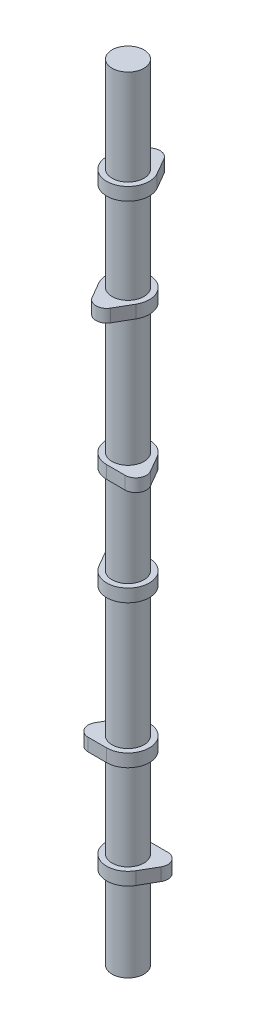
ISO-10303-21;
HEADER;
FILE_DESCRIPTION(('STEP AP214'),'2;1');
FILE_NAME('part.step','',(''),(''),'','','');
FILE_SCHEMA(('AUTOMOTIVE_DESIGN { 1 0 10303 214 1 1 1 1 }'));
ENDSEC;
DATA;
#1=APPLICATION_CONTEXT('core data for automotive mechanical design processes');
#2=APPLICATION_PROTOCOL_DEFINITION('international standard','automotive_design',2000,#1);
#3=PRODUCT_CONTEXT('',#1,'mechanical');
#4=PRODUCT('Part','Part','',(#3));
#5=PRODUCT_RELATED_PRODUCT_CATEGORY('part','',(#4));
#6=PRODUCT_DEFINITION_FORMATION('','',#4);
#7=PRODUCT_DEFINITION_CONTEXT('part definition',#1,'design');
#8=PRODUCT_DEFINITION('design','',#6,#7);
#9=PRODUCT_DEFINITION_SHAPE('','',#8);
#10=(LENGTH_UNIT() NAMED_UNIT(*) SI_UNIT(.MILLI.,.METRE.));
#11=(NAMED_UNIT(*) PLANE_ANGLE_UNIT() SI_UNIT($,.RADIAN.));
#12=(NAMED_UNIT(*) SI_UNIT($,.STERADIAN.) SOLID_ANGLE_UNIT());
#13=UNCERTAINTY_MEASURE_WITH_UNIT(LENGTH_MEASURE(1.E-05),#10,'distance_accuracy_value','');
#14=(GEOMETRIC_REPRESENTATION_CONTEXT(3) GLOBAL_UNCERTAINTY_ASSIGNED_CONTEXT((#13)) GLOBAL_UNIT_ASSIGNED_CONTEXT((#10,
#11,#12)) REPRESENTATION_CONTEXT('',''));
#15=CARTESIAN_POINT('',(0.,0.,0.));
#16=DIRECTION('',(0.,0.,1.));
#17=DIRECTION('',(1.,0.,0.));
#18=AXIS2_PLACEMENT_3D('',#15,#16,#17);
#19=CARTESIAN_POINT('',(0.,3.81,-12.7));
#20=DIRECTION('',(0.,-1.,0.));
#21=DIRECTION('',(0.,0.,-1.));
#22=AXIS2_PLACEMENT_3D('',#19,#20,#21);
#23=CYLINDRICAL_SURFACE('',#22,6.35);
#24=CARTESIAN_POINT('',(0.,-3.81,-12.7));
#25=DIRECTION('',(0.,1.,0.));
#26=DIRECTION('',(0.,0.,1.));
#27=AXIS2_PLACEMENT_3D('',#24,#25,#26);
#28=CIRCLE('',#27,6.35);
#29=CARTESIAN_POINT('',(5.49926131403119,-3.81,-15.875));
#30=VERTEX_POINT('',#29);
#31=CARTESIAN_POINT('',(-5.49926131403119,-3.81,-15.875));
#32=VERTEX_POINT('',#31);
#33=EDGE_CURVE('E438',#30,#32,#28,.T.);
#34=ORIENTED_EDGE('',*,*,#33,.T.);
#35=DIRECTION('',(0.,-1.,0.));
#36=VECTOR('',#35,1.);
#37=CARTESIAN_POINT('',(-5.49926131403119,3.81,-15.875));
#38=LINE('',#37,#36);
#39=CARTESIAN_POINT('',(-5.49926131403119,3.81,-15.875));
#40=VERTEX_POINT('',#39);
#41=EDGE_CURVE('E468',#40,#32,#38,.T.);
#42=ORIENTED_EDGE('',*,*,#41,.F.);
#43=CARTESIAN_POINT('',(0.,3.81,-12.7));
#44=DIRECTION('',(0.,1.,0.));
#45=DIRECTION('',(0.,0.,1.));
#46=AXIS2_PLACEMENT_3D('',#43,#44,#45);
#47=CIRCLE('',#46,6.35);
#48=CARTESIAN_POINT('',(5.49926131403119,3.81,-15.875));
#49=VERTEX_POINT('',#48);
#50=EDGE_CURVE('E439',#49,#40,#47,.T.);
#51=ORIENTED_EDGE('',*,*,#50,.F.);
#52=DIRECTION('',(0.,-1.,0.));
#53=VECTOR('',#52,1.);
#54=CARTESIAN_POINT('',(5.49926131403119,3.81,-15.875));
#55=LINE('',#54,#53);
#56=EDGE_CURVE('E449',#49,#30,#55,.T.);
#57=ORIENTED_EDGE('',*,*,#56,.T.);
#58=EDGE_LOOP('',(#34,#42,#51,#57));
#59=FACE_BOUND('',#58,.T.);
#60=ADVANCED_FACE('F45',(#59),#23,.T.);
#61=CARTESIAN_POINT('',(-5.49926131403119,3.81,-15.875));
#62=DIRECTION('',(0.866025403784439,0.,0.5));
#63=DIRECTION('',(0.5,0.,-0.866025403784439));
#64=AXIS2_PLACEMENT_3D('',#61,#62,#63);
#65=PLANE('',#64);
#66=DIRECTION('',(-0.5,0.,0.866025403784439));
#67=VECTOR('',#66,1.);
#68=CARTESIAN_POINT('',(-5.49926131403119,-3.81,-15.875));
#69=LINE('',#68,#67);
#70=CARTESIAN_POINT('',(-10.9985226280624,-3.81,-6.34999999999999));
#71=VERTEX_POINT('',#70);
#72=EDGE_CURVE('E453',#32,#71,#69,.T.);
#73=ORIENTED_EDGE('',*,*,#72,.T.);
#74=DIRECTION('',(0.,-1.,0.));
#75=VECTOR('',#74,1.);
#76=CARTESIAN_POINT('',(-10.9985226280624,3.81,-6.34999999999999));
#77=LINE('',#76,#75);
#78=CARTESIAN_POINT('',(-10.9985226280624,3.81,-6.34999999999999));
#79=VERTEX_POINT('',#78);
#80=EDGE_CURVE('E465',#79,#71,#77,.T.);
#81=ORIENTED_EDGE('',*,*,#80,.F.);
#82=DIRECTION('',(-0.5,0.,0.866025403784439));
#83=VECTOR('',#82,1.);
#84=CARTESIAN_POINT('',(-5.49926131403119,3.81,-15.875));
#85=LINE('',#84,#83);
#86=EDGE_CURVE('E95',#40,#79,#85,.T.);
#87=ORIENTED_EDGE('',*,*,#86,.F.);
#88=ORIENTED_EDGE('',*,*,#41,.T.);
#89=EDGE_LOOP('',(#73,#81,#87,#88));
#90=FACE_BOUND('',#89,.T.);
#91=ADVANCED_FACE('F542',(#90),#65,.F.);
#92=CARTESIAN_POINT('',(0.,3.81,0.));
#93=DIRECTION('',(0.,-1.,0.));
#94=DIRECTION('',(0.,0.,-1.));
#95=AXIS2_PLACEMENT_3D('',#92,#93,#94);
#96=CYLINDRICAL_SURFACE('',#95,12.7);
#97=CARTESIAN_POINT('',(0.,-3.81,0.));
#98=DIRECTION('',(0.,1.,0.));
#99=DIRECTION('',(0.,0.,1.));
#100=AXIS2_PLACEMENT_3D('',#97,#98,#99);
#101=CIRCLE('',#100,12.7);
#102=CARTESIAN_POINT('',(10.9985226280624,-3.81,-6.35));
#103=VERTEX_POINT('',#102);
#104=EDGE_CURVE('E81',#71,#103,#101,.T.);
#105=ORIENTED_EDGE('',*,*,#104,.T.);
#106=DIRECTION('',(0.,-1.,0.));
#107=VECTOR('',#106,1.);
#108=CARTESIAN_POINT('',(10.9985226280624,3.81,-6.35));
#109=LINE('',#108,#107);
#110=CARTESIAN_POINT('',(10.9985226280624,3.81,-6.35));
#111=VERTEX_POINT('',#110);
#112=EDGE_CURVE('E462',#111,#103,#109,.T.);
#113=ORIENTED_EDGE('',*,*,#112,.F.);
#114=CARTESIAN_POINT('',(0.,3.81,0.));
#115=DIRECTION('',(0.,1.,0.));
#116=DIRECTION('',(0.,0.,1.));
#117=AXIS2_PLACEMENT_3D('',#114,#115,#116);
#118=CIRCLE('',#117,12.7);
#119=EDGE_CURVE('E444',#79,#111,#118,.T.);
#120=ORIENTED_EDGE('',*,*,#119,.F.);
#121=ORIENTED_EDGE('',*,*,#80,.T.);
#122=EDGE_LOOP('',(#105,#113,#120,#121));
#123=FACE_BOUND('',#122,.T.);
#124=ADVANCED_FACE('F547',(#123),#96,.T.);
#125=CARTESIAN_POINT('',(5.49926131403119,3.81,-15.875));
#126=DIRECTION('',(-0.866025403784439,0.,0.5));
#127=DIRECTION('',(0.5,0.,0.866025403784439));
#128=AXIS2_PLACEMENT_3D('',#125,#126,#127);
#129=PLANE('',#128);
#130=DIRECTION('',(-0.5,0.,-0.866025403784439));
#131=VECTOR('',#130,1.);
#132=CARTESIAN_POINT('',(5.49926131403119,-3.81,-15.875));
#133=LINE('',#132,#131);
#134=EDGE_CURVE('E87',#103,#30,#133,.T.);
#135=ORIENTED_EDGE('',*,*,#134,.T.);
#136=ORIENTED_EDGE('',*,*,#56,.F.);
#137=DIRECTION('',(-0.5,0.,-0.866025403784439));
#138=VECTOR('',#137,1.);
#139=CARTESIAN_POINT('',(5.49926131403119,3.81,-15.875));
#140=LINE('',#139,#138);
#141=EDGE_CURVE('E63',#111,#49,#140,.T.);
#142=ORIENTED_EDGE('',*,*,#141,.F.);
#143=ORIENTED_EDGE('',*,*,#112,.T.);
#144=EDGE_LOOP('',(#135,#136,#142,#143));
#145=FACE_BOUND('',#144,.T.);
#146=ADVANCED_FACE('F556',(#145),#129,.F.);
#147=CARTESIAN_POINT('',(0.,3.81,-12.7));
#148=DIRECTION('',(0.,1.,0.));
#149=DIRECTION('',(0.,0.,1.));
#150=AXIS2_PLACEMENT_3D('',#147,#148,#149);
#151=PLANE('',#150);
#152=CARTESIAN_POINT('',(0.,3.81,0.));
#153=DIRECTION('',(0.,1.,0.));
#154=DIRECTION('',(0.,0.,1.));
#155=AXIS2_PLACEMENT_3D('',#152,#153,#154);
#156=CIRCLE('',#155,9.5);
#157=CARTESIAN_POINT('',(0.,3.81,9.5));
#158=VERTEX_POINT('',#157);
#159=EDGE_CURVE('E434',#158,#158,#156,.F.);
#160=ORIENTED_EDGE('',*,*,#159,.T.);
#161=EDGE_LOOP('',(#160));
#162=FACE_BOUND('',#161,.T.);
#163=ORIENTED_EDGE('',*,*,#50,.T.);
#164=ORIENTED_EDGE('',*,*,#86,.T.);
#165=ORIENTED_EDGE('',*,*,#119,.T.);
#166=ORIENTED_EDGE('',*,*,#141,.T.);
#167=EDGE_LOOP('',(#163,#164,#165,#166));
#168=FACE_BOUND('',#167,.T.);
#169=ADVANCED_FACE('F554',(#162,#168),#151,.T.);
#170=CARTESIAN_POINT('',(0.,-3.81,-12.7));
#171=DIRECTION('',(0.,1.,0.));
#172=DIRECTION('',(0.,0.,1.));
#173=AXIS2_PLACEMENT_3D('',#170,#171,#172);
#174=PLANE('',#173);
#175=CARTESIAN_POINT('',(0.,-3.81,0.));
#176=DIRECTION('',(0.,1.,0.));
#177=DIRECTION('',(0.,0.,1.));
#178=AXIS2_PLACEMENT_3D('',#175,#176,#177);
#179=CIRCLE('',#178,9.5);
#180=CARTESIAN_POINT('',(0.,-3.81,9.5));
#181=VERTEX_POINT('',#180);
#182=EDGE_CURVE('E471',#181,#181,#179,.F.);
#183=ORIENTED_EDGE('',*,*,#182,.F.);
#184=EDGE_LOOP('',(#183));
#185=FACE_BOUND('',#184,.T.);
#186=ORIENTED_EDGE('',*,*,#33,.F.);
#187=ORIENTED_EDGE('',*,*,#134,.F.);
#188=ORIENTED_EDGE('',*,*,#104,.F.);
#189=ORIENTED_EDGE('',*,*,#72,.F.);
#190=EDGE_LOOP('',(#186,#187,#188,#189));
#191=FACE_BOUND('',#190,.T.);
#192=ADVANCED_FACE('F552',(#185,#191),#174,.F.);
#193=CARTESIAN_POINT('',(0.,60.53,0.));
#194=DIRECTION('',(0.,-1.,0.));
#195=DIRECTION('',(0.,0.,-1.));
#196=AXIS2_PLACEMENT_3D('',#193,#194,#195);
#197=CYLINDRICAL_SURFACE('',#196,9.5);
#198=CARTESIAN_POINT('',(0.,-57.19,0.));
#199=DIRECTION('',(0.,1.,0.));
#200=DIRECTION('',(0.,0.,1.));
#201=AXIS2_PLACEMENT_3D('',#198,#199,#200);
#202=CIRCLE('',#201,9.5);
#203=CARTESIAN_POINT('',(0.,-57.19,9.5));
#204=VERTEX_POINT('',#203);
#205=EDGE_CURVE('E425',#204,#204,#202,.T.);
#206=ORIENTED_EDGE('',*,*,#205,.T.);
#207=EDGE_LOOP('',(#206));
#208=FACE_BOUND('',#207,.T.);
#209=ORIENTED_EDGE('',*,*,#182,.T.);
#210=EDGE_LOOP('',(#209));
#211=FACE_BOUND('',#210,.T.);
#212=ADVANCED_FACE('F563',(#208,#211),#197,.T.);
#213=ORIENTED_EDGE('',*,*,#159,.F.);
#214=EDGE_LOOP('',(#213));
#215=FACE_BOUND('',#214,.T.);
#216=CARTESIAN_POINT('',(0.,60.53,0.));
#217=DIRECTION('',(0.,1.,0.));
#218=DIRECTION('',(0.,0.,1.));
#219=AXIS2_PLACEMENT_3D('',#216,#217,#218);
#220=CIRCLE('',#219,9.5);
#221=CARTESIAN_POINT('',(0.,60.53,9.5));
#222=VERTEX_POINT('',#221);
#223=EDGE_CURVE('E430',#222,#222,#220,.T.);
#224=ORIENTED_EDGE('',*,*,#223,.F.);
#225=EDGE_LOOP('',(#224));
#226=FACE_BOUND('',#225,.T.);
#227=ADVANCED_FACE('F567',(#215,#226),#197,.T.);
#228=CARTESIAN_POINT('',(0.,60.53,0.));
#229=DIRECTION('',(0.,1.,0.));
#230=DIRECTION('',(0.,0.,1.));
#231=AXIS2_PLACEMENT_3D('',#228,#229,#230);
#232=PLANE('',#231);
#233=ORIENTED_EDGE('',*,*,#223,.T.);
#234=EDGE_LOOP('',(#233));
#235=FACE_BOUND('',#234,.T.);
#236=ADVANCED_FACE('F613',(#235),#232,.T.);
#237=CARTESIAN_POINT('',(0.,-57.19,12.7));
#238=DIRECTION('',(0.,-1.,0.));
#239=DIRECTION('',(0.,0.,1.));
#240=AXIS2_PLACEMENT_3D('',#237,#238,#239);
#241=CYLINDRICAL_SURFACE('',#240,6.35);
#242=CARTESIAN_POINT('',(0.,-64.81,12.7));
#243=DIRECTION('',(0.,1.,0.));
#244=DIRECTION('',(0.,0.,-1.));
#245=AXIS2_PLACEMENT_3D('',#242,#243,#244);
#246=CIRCLE('',#245,6.35);
#247=CARTESIAN_POINT('',(-5.4992613140313,-64.81,15.875));
#248=VERTEX_POINT('',#247);
#249=CARTESIAN_POINT('',(5.49926131403108,-64.81,15.875));
#250=VERTEX_POINT('',#249);
#251=EDGE_CURVE('E398',#248,#250,#246,.T.);
#252=ORIENTED_EDGE('',*,*,#251,.T.);
#253=DIRECTION('',(0.,-1.,0.));
#254=VECTOR('',#253,1.);
#255=CARTESIAN_POINT('',(5.49926131403108,-57.19,15.875));
#256=LINE('',#255,#254);
#257=CARTESIAN_POINT('',(5.49926131403108,-57.19,15.875));
#258=VERTEX_POINT('',#257);
#259=EDGE_CURVE('E421',#258,#250,#256,.T.);
#260=ORIENTED_EDGE('',*,*,#259,.F.);
#261=CARTESIAN_POINT('',(0.,-57.19,12.7));
#262=DIRECTION('',(0.,1.,0.));
#263=DIRECTION('',(0.,0.,-1.));
#264=AXIS2_PLACEMENT_3D('',#261,#262,#263);
#265=CIRCLE('',#264,6.35);
#266=CARTESIAN_POINT('',(-5.4992613140313,-57.19,15.875));
#267=VERTEX_POINT('',#266);
#268=EDGE_CURVE('E383',#267,#258,#265,.T.);
#269=ORIENTED_EDGE('',*,*,#268,.F.);
#270=DIRECTION('',(0.,-1.,0.));
#271=VECTOR('',#270,1.);
#272=CARTESIAN_POINT('',(-5.4992613140313,-57.19,15.875));
#273=LINE('',#272,#271);
#274=EDGE_CURVE('E397',#267,#248,#273,.T.);
#275=ORIENTED_EDGE('',*,*,#274,.T.);
#276=EDGE_LOOP('',(#252,#260,#269,#275));
#277=FACE_BOUND('',#276,.T.);
#278=ADVANCED_FACE('F623',(#277),#241,.T.);
#279=CARTESIAN_POINT('',(5.49926131403108,-57.19,15.875));
#280=DIRECTION('',(-0.866025403784435,0.,-0.500000000000006));
#281=DIRECTION('',(-0.500000000000006,0.,0.866025403784435));
#282=AXIS2_PLACEMENT_3D('',#279,#280,#281);
#283=PLANE('',#282);
#284=DIRECTION('',(0.500000000000006,0.,-0.866025403784435));
#285=VECTOR('',#284,1.);
#286=CARTESIAN_POINT('',(5.49926131403108,-64.81,15.875));
#287=LINE('',#286,#285);
#288=CARTESIAN_POINT('',(10.9985226280623,-64.81,6.35000000000007));
#289=VERTEX_POINT('',#288);
#290=EDGE_CURVE('E402',#250,#289,#287,.T.);
#291=ORIENTED_EDGE('',*,*,#290,.T.);
#292=DIRECTION('',(0.,-1.,0.));
#293=VECTOR('',#292,1.);
#294=CARTESIAN_POINT('',(10.9985226280623,-57.19,6.35000000000007));
#295=LINE('',#294,#293);
#296=CARTESIAN_POINT('',(10.9985226280623,-57.19,6.35000000000007));
#297=VERTEX_POINT('',#296);
#298=EDGE_CURVE('E417',#297,#289,#295,.T.);
#299=ORIENTED_EDGE('',*,*,#298,.F.);
#300=DIRECTION('',(0.500000000000006,0.,-0.866025403784435));
#301=VECTOR('',#300,1.);
#302=CARTESIAN_POINT('',(5.49926131403108,-57.19,15.875));
#303=LINE('',#302,#301);
#304=EDGE_CURVE('E387',#258,#297,#303,.T.);
#305=ORIENTED_EDGE('',*,*,#304,.F.);
#306=ORIENTED_EDGE('',*,*,#259,.T.);
#307=EDGE_LOOP('',(#291,#299,#305,#306));
#308=FACE_BOUND('',#307,.T.);
#309=ADVANCED_FACE('F633',(#308),#283,.F.);
#310=CARTESIAN_POINT('',(0.,-57.19,0.));
#311=DIRECTION('',(0.,-1.,0.));
#312=DIRECTION('',(0.,0.,1.));
#313=AXIS2_PLACEMENT_3D('',#310,#311,#312);
#314=CYLINDRICAL_SURFACE('',#313,12.7);
#315=CARTESIAN_POINT('',(0.,-64.81,0.));
#316=DIRECTION('',(0.,1.,0.));
#317=DIRECTION('',(0.,0.,-1.));
#318=AXIS2_PLACEMENT_3D('',#315,#316,#317);
#319=CIRCLE('',#318,12.7);
#320=CARTESIAN_POINT('',(-10.9985226280624,-64.81,6.34999999999992));
#321=VERTEX_POINT('',#320);
#322=EDGE_CURVE('E405',#289,#321,#319,.T.);
#323=ORIENTED_EDGE('',*,*,#322,.T.);
#324=DIRECTION('',(0.,-1.,0.));
#325=VECTOR('',#324,1.);
#326=CARTESIAN_POINT('',(-10.9985226280624,-57.19,6.34999999999992));
#327=LINE('',#326,#325);
#328=CARTESIAN_POINT('',(-10.9985226280624,-57.19,6.34999999999992));
#329=VERTEX_POINT('',#328);
#330=EDGE_CURVE('E413',#329,#321,#327,.T.);
#331=ORIENTED_EDGE('',*,*,#330,.F.);
#332=CARTESIAN_POINT('',(0.,-57.19,0.));
#333=DIRECTION('',(0.,1.,0.));
#334=DIRECTION('',(0.,0.,-1.));
#335=AXIS2_PLACEMENT_3D('',#332,#333,#334);
#336=CIRCLE('',#335,12.7);
#337=EDGE_CURVE('E391',#297,#329,#336,.T.);
#338=ORIENTED_EDGE('',*,*,#337,.F.);
#339=ORIENTED_EDGE('',*,*,#298,.T.);
#340=EDGE_LOOP('',(#323,#331,#338,#339));
#341=FACE_BOUND('',#340,.T.);
#342=ADVANCED_FACE('F644',(#341),#314,.T.);
#343=CARTESIAN_POINT('',(-5.4992613140313,-57.19,15.875));
#344=DIRECTION('',(0.866025403784442,0.,-0.499999999999994));
#345=DIRECTION('',(-0.499999999999994,0.,-0.866025403784442));
#346=AXIS2_PLACEMENT_3D('',#343,#344,#345);
#347=PLANE('',#346);
#348=DIRECTION('',(0.499999999999994,0.,0.866025403784442));
#349=VECTOR('',#348,1.);
#350=CARTESIAN_POINT('',(-5.4992613140313,-64.81,15.875));
#351=LINE('',#350,#349);
#352=EDGE_CURVE('E388',#321,#248,#351,.T.);
#353=ORIENTED_EDGE('',*,*,#352,.T.);
#354=ORIENTED_EDGE('',*,*,#274,.F.);
#355=DIRECTION('',(0.499999999999994,0.,0.866025403784442));
#356=VECTOR('',#355,1.);
#357=CARTESIAN_POINT('',(-5.4992613140313,-57.19,15.875));
#358=LINE('',#357,#356);
#359=EDGE_CURVE('E394',#329,#267,#358,.T.);
#360=ORIENTED_EDGE('',*,*,#359,.F.);
#361=ORIENTED_EDGE('',*,*,#330,.T.);
#362=EDGE_LOOP('',(#353,#354,#360,#361));
#363=FACE_BOUND('',#362,.T.);
#364=ADVANCED_FACE('F655',(#363),#347,.F.);
#365=CARTESIAN_POINT('',(0.,-57.19,12.7));
#366=DIRECTION('',(0.,1.,0.));
#367=DIRECTION('',(0.,0.,-1.));
#368=AXIS2_PLACEMENT_3D('',#365,#366,#367);
#369=PLANE('',#368);
#370=ORIENTED_EDGE('',*,*,#205,.F.);
#371=EDGE_LOOP('',(#370));
#372=FACE_BOUND('',#371,.T.);
#373=ORIENTED_EDGE('',*,*,#268,.T.);
#374=ORIENTED_EDGE('',*,*,#304,.T.);
#375=ORIENTED_EDGE('',*,*,#337,.T.);
#376=ORIENTED_EDGE('',*,*,#359,.T.);
#377=EDGE_LOOP('',(#373,#374,#375,#376));
#378=FACE_BOUND('',#377,.T.);
#379=ADVANCED_FACE('F666',(#372,#378),#369,.T.);
#380=CARTESIAN_POINT('',(0.,-64.81,12.7));
#381=DIRECTION('',(0.,1.,0.));
#382=DIRECTION('',(0.,0.,-1.));
#383=AXIS2_PLACEMENT_3D('',#380,#381,#382);
#384=PLANE('',#383);
#385=CARTESIAN_POINT('',(0.,-64.81,0.));
#386=DIRECTION('',(0.,1.,0.));
#387=DIRECTION('',(0.,0.,1.));
#388=AXIS2_PLACEMENT_3D('',#385,#386,#387);
#389=CIRCLE('',#388,9.5);
#390=CARTESIAN_POINT('',(0.,-64.81,9.5));
#391=VERTEX_POINT('',#390);
#392=EDGE_CURVE('E475',#391,#391,#389,.T.);
#393=ORIENTED_EDGE('',*,*,#392,.T.);
#394=EDGE_LOOP('',(#393));
#395=FACE_BOUND('',#394,.T.);
#396=ORIENTED_EDGE('',*,*,#251,.F.);
#397=ORIENTED_EDGE('',*,*,#352,.F.);
#398=ORIENTED_EDGE('',*,*,#322,.F.);
#399=ORIENTED_EDGE('',*,*,#290,.F.);
#400=EDGE_LOOP('',(#396,#397,#398,#399));
#401=FACE_BOUND('',#400,.T.);
#402=ADVANCED_FACE('F677',(#395,#401),#384,.F.);
#403=CARTESIAN_POINT('',(0.,-142.24,0.));
#404=DIRECTION('',(0.,1.,0.));
#405=DIRECTION('',(0.,0.,1.));
#406=AXIS2_PLACEMENT_3D('',#403,#404,#405);
#407=CIRCLE('',#406,9.5);
#408=CARTESIAN_POINT('',(0.,-142.24,9.5));
#409=VERTEX_POINT('',#408);
#410=EDGE_CURVE('E382',#409,#409,#407,.T.);
#411=ORIENTED_EDGE('',*,*,#410,.T.);
#412=EDGE_LOOP('',(#411));
#413=FACE_BOUND('',#412,.T.);
#414=ORIENTED_EDGE('',*,*,#392,.F.);
#415=EDGE_LOOP('',(#414));
#416=FACE_BOUND('',#415,.T.);
#417=ADVANCED_FACE('F603',(#413,#416),#197,.T.);
#418=CARTESIAN_POINT('',(10.9985226280623,-142.24,6.35000000000005));
#419=DIRECTION('',(0.,-1.,0.));
#420=DIRECTION('',(0.866025403784436,0.,0.500000000000004));
#421=AXIS2_PLACEMENT_3D('',#418,#419,#420);
#422=CYLINDRICAL_SURFACE('',#421,6.35);
#423=CARTESIAN_POINT('',(10.9985226280623,-149.86,6.35000000000005));
#424=DIRECTION('',(0.,1.,0.));
#425=DIRECTION('',(-0.866025403784436,0.,-0.500000000000004));
#426=AXIS2_PLACEMENT_3D('',#423,#424,#425);
#427=CIRCLE('',#426,6.35);
#428=CARTESIAN_POINT('',(10.9985226280623,-149.86,12.7000000000001));
#429=VERTEX_POINT('',#428);
#430=CARTESIAN_POINT('',(16.4977839420935,-149.86,3.17500000000008));
#431=VERTEX_POINT('',#430);
#432=EDGE_CURVE('E355',#429,#431,#427,.T.);
#433=ORIENTED_EDGE('',*,*,#432,.T.);
#434=DIRECTION('',(0.,-1.,0.));
#435=VECTOR('',#434,1.);
#436=CARTESIAN_POINT('',(16.4977839420935,-142.24,3.17500000000008));
#437=LINE('',#436,#435);
#438=CARTESIAN_POINT('',(16.4977839420935,-142.24,3.17500000000008));
#439=VERTEX_POINT('',#438);
#440=EDGE_CURVE('E378',#439,#431,#437,.T.);
#441=ORIENTED_EDGE('',*,*,#440,.F.);
#442=CARTESIAN_POINT('',(10.9985226280623,-142.24,6.35000000000005));
#443=DIRECTION('',(0.,1.,0.));
#444=DIRECTION('',(-0.866025403784436,0.,-0.500000000000004));
#445=AXIS2_PLACEMENT_3D('',#442,#443,#444);
#446=CIRCLE('',#445,6.35);
#447=CARTESIAN_POINT('',(10.9985226280623,-142.24,12.7000000000001));
#448=VERTEX_POINT('',#447);
#449=EDGE_CURVE('E340',#448,#439,#446,.T.);
#450=ORIENTED_EDGE('',*,*,#449,.F.);
#451=DIRECTION('',(0.,-1.,0.));
#452=VECTOR('',#451,1.);
#453=CARTESIAN_POINT('',(10.9985226280623,-142.24,12.7000000000001));
#454=LINE('',#453,#452);
#455=EDGE_CURVE('E354',#448,#429,#454,.T.);
#456=ORIENTED_EDGE('',*,*,#455,.T.);
#457=EDGE_LOOP('',(#433,#441,#450,#456));
#458=FACE_BOUND('',#457,.T.);
#459=ADVANCED_FACE('F698',(#458),#422,.T.);
#460=CARTESIAN_POINT('',(16.4977839420935,-142.24,3.17500000000008));
#461=DIRECTION('',(-0.866025403784441,0.,0.499999999999997));
#462=DIRECTION('',(0.499999999999997,0.,0.866025403784441));
#463=AXIS2_PLACEMENT_3D('',#460,#461,#462);
#464=PLANE('',#463);
#465=DIRECTION('',(-0.499999999999997,0.,-0.866025403784441));
#466=VECTOR('',#465,1.);
#467=CARTESIAN_POINT('',(16.4977839420935,-149.86,3.17500000000008));
#468=LINE('',#467,#466);
#469=CARTESIAN_POINT('',(10.9985226280624,-149.86,-6.34999999999995));
#470=VERTEX_POINT('',#469);
#471=EDGE_CURVE('E359',#431,#470,#468,.T.);
#472=ORIENTED_EDGE('',*,*,#471,.T.);
#473=DIRECTION('',(0.,-1.,0.));
#474=VECTOR('',#473,1.);
#475=CARTESIAN_POINT('',(10.9985226280624,-142.24,-6.34999999999995));
#476=LINE('',#475,#474);
#477=CARTESIAN_POINT('',(10.9985226280624,-142.24,-6.34999999999995));
#478=VERTEX_POINT('',#477);
#479=EDGE_CURVE('E374',#478,#470,#476,.T.);
#480=ORIENTED_EDGE('',*,*,#479,.F.);
#481=DIRECTION('',(-0.499999999999997,0.,-0.866025403784441));
#482=VECTOR('',#481,1.);
#483=CARTESIAN_POINT('',(16.4977839420935,-142.24,3.17500000000008));
#484=LINE('',#483,#482);
#485=EDGE_CURVE('E344',#439,#478,#484,.T.);
#486=ORIENTED_EDGE('',*,*,#485,.F.);
#487=ORIENTED_EDGE('',*,*,#440,.T.);
#488=EDGE_LOOP('',(#472,#480,#486,#487));
#489=FACE_BOUND('',#488,.T.);
#490=ADVANCED_FACE('F709',(#489),#464,.F.);
#491=CARTESIAN_POINT('',(0.,-142.24,0.));
#492=DIRECTION('',(0.,-1.,0.));
#493=DIRECTION('',(0.866025403784436,0.,0.500000000000004));
#494=AXIS2_PLACEMENT_3D('',#491,#492,#493);
#495=CYLINDRICAL_SURFACE('',#494,12.7);
#496=CARTESIAN_POINT('',(0.,-149.86,0.));
#497=DIRECTION('',(0.,1.,0.));
#498=DIRECTION('',(-0.866025403784436,0.,-0.500000000000004));
#499=AXIS2_PLACEMENT_3D('',#496,#497,#498);
#500=CIRCLE('',#499,12.7);
#501=CARTESIAN_POINT('',(0.,-149.86,12.7));
#502=VERTEX_POINT('',#501);
#503=EDGE_CURVE('E362',#470,#502,#500,.T.);
#504=ORIENTED_EDGE('',*,*,#503,.T.);
#505=DIRECTION('',(0.,-1.,0.));
#506=VECTOR('',#505,1.);
#507=CARTESIAN_POINT('',(0.,-142.24,12.7));
#508=LINE('',#507,#506);
#509=CARTESIAN_POINT('',(0.,-142.24,12.7));
#510=VERTEX_POINT('',#509);
#511=EDGE_CURVE('E370',#510,#502,#508,.T.);
#512=ORIENTED_EDGE('',*,*,#511,.F.);
#513=CARTESIAN_POINT('',(0.,-142.24,0.));
#514=DIRECTION('',(0.,1.,0.));
#515=DIRECTION('',(-0.866025403784436,0.,-0.500000000000004));
#516=AXIS2_PLACEMENT_3D('',#513,#514,#515);
#517=CIRCLE('',#516,12.7);
#518=EDGE_CURVE('E348',#478,#510,#517,.T.);
#519=ORIENTED_EDGE('',*,*,#518,.F.);
#520=ORIENTED_EDGE('',*,*,#479,.T.);
#521=EDGE_LOOP('',(#504,#512,#519,#520));
#522=FACE_BOUND('',#521,.T.);
#523=ADVANCED_FACE('F720',(#522),#495,.T.);
#524=CARTESIAN_POINT('',(10.9985226280623,-142.24,12.7000000000001));
#525=DIRECTION('',(0.,0.,-1.));
#526=DIRECTION('',(-1.,0.,0.));
#527=AXIS2_PLACEMENT_3D('',#524,#525,#526);
#528=PLANE('',#527);
#529=DIRECTION('',(1.,0.,0.));
#530=VECTOR('',#529,1.);
#531=CARTESIAN_POINT('',(10.9985226280623,-149.86,12.7000000000001));
#532=LINE('',#531,#530);
#533=EDGE_CURVE('E345',#502,#429,#532,.T.);
#534=ORIENTED_EDGE('',*,*,#533,.T.);
#535=ORIENTED_EDGE('',*,*,#455,.F.);
#536=DIRECTION('',(1.,0.,0.));
#537=VECTOR('',#536,1.);
#538=CARTESIAN_POINT('',(10.9985226280623,-142.24,12.7000000000001));
#539=LINE('',#538,#537);
#540=EDGE_CURVE('E351',#510,#448,#539,.T.);
#541=ORIENTED_EDGE('',*,*,#540,.F.);
#542=ORIENTED_EDGE('',*,*,#511,.T.);
#543=EDGE_LOOP('',(#534,#535,#541,#542));
#544=FACE_BOUND('',#543,.T.);
#545=ADVANCED_FACE('F731',(#544),#528,.F.);
#546=CARTESIAN_POINT('',(10.9985226280623,-142.24,6.35000000000005));
#547=DIRECTION('',(0.,1.,0.));
#548=DIRECTION('',(-0.866025403784436,0.,-0.500000000000004));
#549=AXIS2_PLACEMENT_3D('',#546,#547,#548);
#550=PLANE('',#549);
#551=ORIENTED_EDGE('',*,*,#410,.F.);
#552=EDGE_LOOP('',(#551));
#553=FACE_BOUND('',#552,.T.);
#554=ORIENTED_EDGE('',*,*,#449,.T.);
#555=ORIENTED_EDGE('',*,*,#485,.T.);
#556=ORIENTED_EDGE('',*,*,#518,.T.);
#557=ORIENTED_EDGE('',*,*,#540,.T.);
#558=EDGE_LOOP('',(#554,#555,#556,#557));
#559=FACE_BOUND('',#558,.T.);
#560=ADVANCED_FACE('F742',(#553,#559),#550,.T.);
#561=CARTESIAN_POINT('',(10.9985226280623,-149.86,6.35000000000005));
#562=DIRECTION('',(0.,1.,0.));
#563=DIRECTION('',(-0.866025403784436,0.,-0.500000000000004));
#564=AXIS2_PLACEMENT_3D('',#561,#562,#563);
#565=PLANE('',#564);
#566=CARTESIAN_POINT('',(0.,-149.86,0.));
#567=DIRECTION('',(0.,1.,0.));
#568=DIRECTION('',(0.,0.,1.));
#569=AXIS2_PLACEMENT_3D('',#566,#567,#568);
#570=CIRCLE('',#569,9.5);
#571=CARTESIAN_POINT('',(0.,-149.86,9.5));
#572=VERTEX_POINT('',#571);
#573=EDGE_CURVE('E479',#572,#572,#570,.T.);
#574=ORIENTED_EDGE('',*,*,#573,.T.);
#575=EDGE_LOOP('',(#574));
#576=FACE_BOUND('',#575,.T.);
#577=ORIENTED_EDGE('',*,*,#432,.F.);
#578=ORIENTED_EDGE('',*,*,#533,.F.);
#579=ORIENTED_EDGE('',*,*,#503,.F.);
#580=ORIENTED_EDGE('',*,*,#471,.F.);
#581=EDGE_LOOP('',(#577,#578,#579,#580));
#582=FACE_BOUND('',#581,.T.);
#583=ADVANCED_FACE('F753',(#576,#582),#565,.F.);
#584=CARTESIAN_POINT('',(0.,-203.24,0.));
#585=DIRECTION('',(0.,1.,0.));
#586=DIRECTION('',(0.,0.,1.));
#587=AXIS2_PLACEMENT_3D('',#584,#585,#586);
#588=CIRCLE('',#587,9.5);
#589=CARTESIAN_POINT('',(0.,-203.24,9.5));
#590=VERTEX_POINT('',#589);
#591=EDGE_CURVE('E339',#590,#590,#588,.T.);
#592=ORIENTED_EDGE('',*,*,#591,.T.);
#593=EDGE_LOOP('',(#592));
#594=FACE_BOUND('',#593,.T.);
#595=ORIENTED_EDGE('',*,*,#573,.F.);
#596=EDGE_LOOP('',(#595));
#597=FACE_BOUND('',#596,.T.);
#598=ADVANCED_FACE('F700',(#594,#597),#197,.T.);
#599=CARTESIAN_POINT('',(-10.9985226280623,-203.24,-6.35000000000013));
#600=DIRECTION('',(0.,-1.,0.));
#601=DIRECTION('',(-0.866025403784433,0.,-0.50000000000001));
#602=AXIS2_PLACEMENT_3D('',#599,#600,#601);
#603=CYLINDRICAL_SURFACE('',#602,6.35);
#604=CARTESIAN_POINT('',(-10.9985226280623,-210.86,-6.35000000000013));
#605=DIRECTION('',(0.,1.,0.));
#606=DIRECTION('',(0.866025403784433,0.,0.50000000000001));
#607=AXIS2_PLACEMENT_3D('',#604,#605,#606);
#608=CIRCLE('',#607,6.35);
#609=CARTESIAN_POINT('',(-10.9985226280622,-210.86,-12.7000000000001));
#610=VERTEX_POINT('',#609);
#611=CARTESIAN_POINT('',(-16.4977839420935,-210.86,-3.17500000000019));
#612=VERTEX_POINT('',#611);
#613=EDGE_CURVE('E312',#610,#612,#608,.T.);
#614=ORIENTED_EDGE('',*,*,#613,.T.);
#615=DIRECTION('',(0.,-1.,0.));
#616=VECTOR('',#615,1.);
#617=CARTESIAN_POINT('',(-16.4977839420935,-203.24,-3.17500000000019));
#618=LINE('',#617,#616);
#619=CARTESIAN_POINT('',(-16.4977839420935,-203.24,-3.17500000000019));
#620=VERTEX_POINT('',#619);
#621=EDGE_CURVE('E335',#620,#612,#618,.T.);
#622=ORIENTED_EDGE('',*,*,#621,.F.);
#623=CARTESIAN_POINT('',(-10.9985226280623,-203.24,-6.35000000000013));
#624=DIRECTION('',(0.,1.,0.));
#625=DIRECTION('',(0.866025403784433,0.,0.50000000000001));
#626=AXIS2_PLACEMENT_3D('',#623,#624,#625);
#627=CIRCLE('',#626,6.35);
#628=CARTESIAN_POINT('',(-10.9985226280622,-203.24,-12.7000000000001));
#629=VERTEX_POINT('',#628);
#630=EDGE_CURVE('E297',#629,#620,#627,.T.);
#631=ORIENTED_EDGE('',*,*,#630,.F.);
#632=DIRECTION('',(0.,-1.,0.));
#633=VECTOR('',#632,1.);
#634=CARTESIAN_POINT('',(-10.9985226280622,-203.24,-12.7000000000001));
#635=LINE('',#634,#633);
#636=EDGE_CURVE('E311',#629,#610,#635,.T.);
#637=ORIENTED_EDGE('',*,*,#636,.T.);
#638=EDGE_LOOP('',(#614,#622,#631,#637));
#639=FACE_BOUND('',#638,.T.);
#640=ADVANCED_FACE('F774',(#639),#603,.T.);
#641=CARTESIAN_POINT('',(-16.4977839420935,-203.24,-3.17500000000019));
#642=DIRECTION('',(0.866025403784444,0.,-0.499999999999991));
#643=DIRECTION('',(-0.499999999999991,0.,-0.866025403784444));
#644=AXIS2_PLACEMENT_3D('',#641,#642,#643);
#645=PLANE('',#644);
#646=DIRECTION('',(0.499999999999991,0.,0.866025403784444));
#647=VECTOR('',#646,1.);
#648=CARTESIAN_POINT('',(-16.4977839420935,-210.86,-3.17500000000019));
#649=LINE('',#648,#647);
#650=CARTESIAN_POINT('',(-10.9985226280624,-210.86,6.34999999999988));
#651=VERTEX_POINT('',#650);
#652=EDGE_CURVE('E316',#612,#651,#649,.T.);
#653=ORIENTED_EDGE('',*,*,#652,.T.);
#654=DIRECTION('',(0.,-1.,0.));
#655=VECTOR('',#654,1.);
#656=CARTESIAN_POINT('',(-10.9985226280624,-203.24,6.34999999999988));
#657=LINE('',#656,#655);
#658=CARTESIAN_POINT('',(-10.9985226280624,-203.24,6.34999999999988));
#659=VERTEX_POINT('',#658);
#660=EDGE_CURVE('E331',#659,#651,#657,.T.);
#661=ORIENTED_EDGE('',*,*,#660,.F.);
#662=DIRECTION('',(0.499999999999991,0.,0.866025403784444));
#663=VECTOR('',#662,1.);
#664=CARTESIAN_POINT('',(-16.4977839420935,-203.24,-3.17500000000019));
#665=LINE('',#664,#663);
#666=EDGE_CURVE('E301',#620,#659,#665,.T.);
#667=ORIENTED_EDGE('',*,*,#666,.F.);
#668=ORIENTED_EDGE('',*,*,#621,.T.);
#669=EDGE_LOOP('',(#653,#661,#667,#668));
#670=FACE_BOUND('',#669,.T.);
#671=ADVANCED_FACE('F784',(#670),#645,.F.);
#672=CARTESIAN_POINT('',(0.,-203.24,0.));
#673=DIRECTION('',(0.,-1.,0.));
#674=DIRECTION('',(-0.866025403784433,0.,-0.50000000000001));
#675=AXIS2_PLACEMENT_3D('',#672,#673,#674);
#676=CYLINDRICAL_SURFACE('',#675,12.7);
#677=CARTESIAN_POINT('',(0.,-210.86,0.));
#678=DIRECTION('',(0.,1.,0.));
#679=DIRECTION('',(0.866025403784433,0.,0.50000000000001));
#680=AXIS2_PLACEMENT_3D('',#677,#678,#679);
#681=CIRCLE('',#680,12.7);
#682=CARTESIAN_POINT('',(1.47451495458029E-13,-210.86,-12.7));
#683=VERTEX_POINT('',#682);
#684=EDGE_CURVE('E319',#651,#683,#681,.T.);
#685=ORIENTED_EDGE('',*,*,#684,.T.);
#686=DIRECTION('',(0.,-1.,0.));
#687=VECTOR('',#686,1.);
#688=CARTESIAN_POINT('',(1.47451495458029E-13,-203.24,-12.7));
#689=LINE('',#688,#687);
#690=CARTESIAN_POINT('',(1.47451495458029E-13,-203.24,-12.7));
#691=VERTEX_POINT('',#690);
#692=EDGE_CURVE('E327',#691,#683,#689,.T.);
#693=ORIENTED_EDGE('',*,*,#692,.F.);
#694=CARTESIAN_POINT('',(0.,-203.24,0.));
#695=DIRECTION('',(0.,1.,0.));
#696=DIRECTION('',(0.866025403784433,0.,0.50000000000001));
#697=AXIS2_PLACEMENT_3D('',#694,#695,#696);
#698=CIRCLE('',#697,12.7);
#699=EDGE_CURVE('E305',#659,#691,#698,.T.);
#700=ORIENTED_EDGE('',*,*,#699,.F.);
#701=ORIENTED_EDGE('',*,*,#660,.T.);
#702=EDGE_LOOP('',(#685,#693,#700,#701));
#703=FACE_BOUND('',#702,.T.);
#704=ADVANCED_FACE('F795',(#703),#676,.T.);
#705=CARTESIAN_POINT('',(-10.9985226280622,-203.24,-12.7000000000001));
#706=DIRECTION('',(0.,0.,1.));
#707=DIRECTION('',(1.,0.,0.));
#708=AXIS2_PLACEMENT_3D('',#705,#706,#707);
#709=PLANE('',#708);
#710=DIRECTION('',(-1.,0.,0.));
#711=VECTOR('',#710,1.);
#712=CARTESIAN_POINT('',(-10.9985226280622,-210.86,-12.7000000000001));
#713=LINE('',#712,#711);
#714=EDGE_CURVE('E302',#683,#610,#713,.T.);
#715=ORIENTED_EDGE('',*,*,#714,.T.);
#716=ORIENTED_EDGE('',*,*,#636,.F.);
#717=DIRECTION('',(-1.,0.,0.));
#718=VECTOR('',#717,1.);
#719=CARTESIAN_POINT('',(-10.9985226280622,-203.24,-12.7000000000001));
#720=LINE('',#719,#718);
#721=EDGE_CURVE('E308',#691,#629,#720,.T.);
#722=ORIENTED_EDGE('',*,*,#721,.F.);
#723=ORIENTED_EDGE('',*,*,#692,.T.);
#724=EDGE_LOOP('',(#715,#716,#722,#723));
#725=FACE_BOUND('',#724,.T.);
#726=ADVANCED_FACE('F806',(#725),#709,.F.);
#727=CARTESIAN_POINT('',(-10.9985226280623,-203.24,-6.35000000000013));
#728=DIRECTION('',(0.,1.,0.));
#729=DIRECTION('',(0.866025403784433,0.,0.50000000000001));
#730=AXIS2_PLACEMENT_3D('',#727,#728,#729);
#731=PLANE('',#730);
#732=ORIENTED_EDGE('',*,*,#591,.F.);
#733=EDGE_LOOP('',(#732));
#734=FACE_BOUND('',#733,.T.);
#735=ORIENTED_EDGE('',*,*,#630,.T.);
#736=ORIENTED_EDGE('',*,*,#666,.T.);
#737=ORIENTED_EDGE('',*,*,#699,.T.);
#738=ORIENTED_EDGE('',*,*,#721,.T.);
#739=EDGE_LOOP('',(#735,#736,#737,#738));
#740=FACE_BOUND('',#739,.T.);
#741=ADVANCED_FACE('F817',(#734,#740),#731,.T.);
#742=CARTESIAN_POINT('',(-10.9985226280623,-210.86,-6.35000000000013));
#743=DIRECTION('',(0.,1.,0.));
#744=DIRECTION('',(0.866025403784433,0.,0.50000000000001));
#745=AXIS2_PLACEMENT_3D('',#742,#743,#744);
#746=PLANE('',#745);
#747=CARTESIAN_POINT('',(0.,-210.86,0.));
#748=DIRECTION('',(0.,1.,0.));
#749=DIRECTION('',(0.,0.,1.));
#750=AXIS2_PLACEMENT_3D('',#747,#748,#749);
#751=CIRCLE('',#750,9.5);
#752=CARTESIAN_POINT('',(0.,-210.86,9.5));
#753=VERTEX_POINT('',#752);
#754=EDGE_CURVE('E486',#753,#753,#751,.T.);
#755=ORIENTED_EDGE('',*,*,#754,.T.);
#756=EDGE_LOOP('',(#755));
#757=FACE_BOUND('',#756,.T.);
#758=ORIENTED_EDGE('',*,*,#613,.F.);
#759=ORIENTED_EDGE('',*,*,#714,.F.);
#760=ORIENTED_EDGE('',*,*,#684,.F.);
#761=ORIENTED_EDGE('',*,*,#652,.F.);
#762=EDGE_LOOP('',(#758,#759,#760,#761));
#763=FACE_BOUND('',#762,.T.);
#764=ADVANCED_FACE('F828',(#757,#763),#746,.F.);
#765=CARTESIAN_POINT('',(0.,-288.29,0.));
#766=DIRECTION('',(0.,1.,0.));
#767=DIRECTION('',(0.,0.,1.));
#768=AXIS2_PLACEMENT_3D('',#765,#766,#767);
#769=CIRCLE('',#768,9.5);
#770=CARTESIAN_POINT('',(0.,-288.29,9.5));
#771=VERTEX_POINT('',#770);
#772=EDGE_CURVE('E296',#771,#771,#769,.T.);
#773=ORIENTED_EDGE('',*,*,#772,.T.);
#774=EDGE_LOOP('',(#773));
#775=FACE_BOUND('',#774,.T.);
#776=ORIENTED_EDGE('',*,*,#754,.F.);
#777=EDGE_LOOP('',(#776));
#778=FACE_BOUND('',#777,.T.);
#779=ADVANCED_FACE('F503',(#775,#778),#197,.T.);
#780=CARTESIAN_POINT('',(-10.9985226280624,-288.29,6.3499999999999));
#781=DIRECTION('',(0.,-1.,0.));
#782=DIRECTION('',(-0.866025403784443,0.,0.499999999999992));
#783=AXIS2_PLACEMENT_3D('',#780,#781,#782);
#784=CYLINDRICAL_SURFACE('',#783,6.35);
#785=CARTESIAN_POINT('',(-10.9985226280624,-295.91,6.3499999999999));
#786=DIRECTION('',(0.,1.,0.));
#787=DIRECTION('',(0.866025403784443,0.,-0.499999999999992));
#788=AXIS2_PLACEMENT_3D('',#785,#786,#787);
#789=CIRCLE('',#788,6.35);
#790=CARTESIAN_POINT('',(-16.4977839420936,-295.91,3.17499999999985));
#791=VERTEX_POINT('',#790);
#792=CARTESIAN_POINT('',(-10.9985226280625,-295.91,12.6999999999999));
#793=VERTEX_POINT('',#792);
#794=EDGE_CURVE('E250',#791,#793,#789,.T.);
#795=ORIENTED_EDGE('',*,*,#794,.T.);
#796=DIRECTION('',(0.,-1.,0.));
#797=VECTOR('',#796,1.);
#798=CARTESIAN_POINT('',(-10.9985226280625,-288.29,12.6999999999999));
#799=LINE('',#798,#797);
#800=CARTESIAN_POINT('',(-10.9985226280625,-288.29,12.6999999999999));
#801=VERTEX_POINT('',#800);
#802=EDGE_CURVE('E292',#801,#793,#799,.T.);
#803=ORIENTED_EDGE('',*,*,#802,.F.);
#804=CARTESIAN_POINT('',(-10.9985226280624,-288.29,6.3499999999999));
#805=DIRECTION('',(0.,1.,0.));
#806=DIRECTION('',(0.866025403784443,0.,-0.499999999999992));
#807=AXIS2_PLACEMENT_3D('',#804,#805,#806);
#808=CIRCLE('',#807,6.35);
#809=CARTESIAN_POINT('',(-16.4977839420936,-288.29,3.17499999999985));
#810=VERTEX_POINT('',#809);
#811=EDGE_CURVE('E255',#810,#801,#808,.T.);
#812=ORIENTED_EDGE('',*,*,#811,.F.);
#813=DIRECTION('',(0.,-1.,0.));
#814=VECTOR('',#813,1.);
#815=CARTESIAN_POINT('',(-16.4977839420936,-288.29,3.17499999999985));
#816=LINE('',#815,#814);
#817=EDGE_CURVE('E269',#810,#791,#816,.T.);
#818=ORIENTED_EDGE('',*,*,#817,.T.);
#819=EDGE_LOOP('',(#795,#803,#812,#818));
#820=FACE_BOUND('',#819,.T.);
#821=ADVANCED_FACE('F518',(#820),#784,.T.);
#822=CARTESIAN_POINT('',(-10.9985226280625,-288.29,12.6999999999999));
#823=DIRECTION('',(0.,0.,-1.));
#824=DIRECTION('',(-1.,0.,0.));
#825=AXIS2_PLACEMENT_3D('',#822,#823,#824);
#826=PLANE('',#825);
#827=DIRECTION('',(1.,0.,0.));
#828=VECTOR('',#827,1.);
#829=CARTESIAN_POINT('',(-10.9985226280625,-295.91,12.6999999999999));
#830=LINE('',#829,#828);
#831=CARTESIAN_POINT('',(-1.11889664200504E-13,-295.91,12.7));
#832=VERTEX_POINT('',#831);
#833=EDGE_CURVE('E273',#793,#832,#830,.T.);
#834=ORIENTED_EDGE('',*,*,#833,.T.);
#835=DIRECTION('',(0.,-1.,0.));
#836=VECTOR('',#835,1.);
#837=CARTESIAN_POINT('',(-1.11889664200504E-13,-288.29,12.7));
#838=LINE('',#837,#836);
#839=CARTESIAN_POINT('',(-1.11889664200504E-13,-288.29,12.7));
#840=VERTEX_POINT('',#839);
#841=EDGE_CURVE('E288',#840,#832,#838,.T.);
#842=ORIENTED_EDGE('',*,*,#841,.F.);
#843=DIRECTION('',(1.,0.,0.));
#844=VECTOR('',#843,1.);
#845=CARTESIAN_POINT('',(-10.9985226280625,-288.29,12.6999999999999));
#846=LINE('',#845,#844);
#847=EDGE_CURVE('E259',#801,#840,#846,.T.);
#848=ORIENTED_EDGE('',*,*,#847,.F.);
#849=ORIENTED_EDGE('',*,*,#802,.T.);
#850=EDGE_LOOP('',(#834,#842,#848,#849));
#851=FACE_BOUND('',#850,.T.);
#852=ADVANCED_FACE('F521',(#851),#826,.F.);
#853=CARTESIAN_POINT('',(0.,-288.29,0.));
#854=DIRECTION('',(0.,-1.,0.));
#855=DIRECTION('',(-0.866025403784443,0.,0.499999999999992));
#856=AXIS2_PLACEMENT_3D('',#853,#854,#855);
#857=CYLINDRICAL_SURFACE('',#856,12.7);
#858=CARTESIAN_POINT('',(0.,-295.91,0.));
#859=DIRECTION('',(0.,1.,0.));
#860=DIRECTION('',(0.866025403784443,0.,-0.499999999999992));
#861=AXIS2_PLACEMENT_3D('',#858,#859,#860);
#862=CIRCLE('',#861,12.7);
#863=CARTESIAN_POINT('',(-10.9985226280623,-295.91,-6.3500000000001));
#864=VERTEX_POINT('',#863);
#865=EDGE_CURVE('E276',#832,#864,#862,.T.);
#866=ORIENTED_EDGE('',*,*,#865,.T.);
#867=DIRECTION('',(0.,-1.,0.));
#868=VECTOR('',#867,1.);
#869=CARTESIAN_POINT('',(-10.9985226280623,-288.29,-6.3500000000001));
#870=LINE('',#869,#868);
#871=CARTESIAN_POINT('',(-10.9985226280623,-288.29,-6.3500000000001));
#872=VERTEX_POINT('',#871);
#873=EDGE_CURVE('E284',#872,#864,#870,.T.);
#874=ORIENTED_EDGE('',*,*,#873,.F.);
#875=CARTESIAN_POINT('',(0.,-288.29,0.));
#876=DIRECTION('',(0.,1.,0.));
#877=DIRECTION('',(0.866025403784443,0.,-0.499999999999992));
#878=AXIS2_PLACEMENT_3D('',#875,#876,#877);
#879=CIRCLE('',#878,12.7);
#880=EDGE_CURVE('E263',#840,#872,#879,.T.);
#881=ORIENTED_EDGE('',*,*,#880,.F.);
#882=ORIENTED_EDGE('',*,*,#841,.T.);
#883=EDGE_LOOP('',(#866,#874,#881,#882));
#884=FACE_BOUND('',#883,.T.);
#885=ADVANCED_FACE('F526',(#884),#857,.T.);
#886=CARTESIAN_POINT('',(-16.4977839420936,-288.29,3.17499999999985));
#887=DIRECTION('',(0.866025403784434,0.,0.500000000000008));
#888=DIRECTION('',(0.500000000000008,0.,-0.866025403784434));
#889=AXIS2_PLACEMENT_3D('',#886,#887,#888);
#890=PLANE('',#889);
#891=DIRECTION('',(-0.500000000000008,0.,0.866025403784434));
#892=VECTOR('',#891,1.);
#893=CARTESIAN_POINT('',(-16.4977839420936,-295.91,3.17499999999985));
#894=LINE('',#893,#892);
#895=EDGE_CURVE('E260',#864,#791,#894,.T.);
#896=ORIENTED_EDGE('',*,*,#895,.T.);
#897=ORIENTED_EDGE('',*,*,#817,.F.);
#898=DIRECTION('',(-0.500000000000008,0.,0.866025403784434));
#899=VECTOR('',#898,1.);
#900=CARTESIAN_POINT('',(-16.4977839420936,-288.29,3.17499999999985));
#901=LINE('',#900,#899);
#902=EDGE_CURVE('E266',#872,#810,#901,.T.);
#903=ORIENTED_EDGE('',*,*,#902,.F.);
#904=ORIENTED_EDGE('',*,*,#873,.T.);
#905=EDGE_LOOP('',(#896,#897,#903,#904));
#906=FACE_BOUND('',#905,.T.);
#907=ADVANCED_FACE('F510',(#906),#890,.F.);
#908=CARTESIAN_POINT('',(-10.9985226280624,-288.29,6.3499999999999));
#909=DIRECTION('',(0.,1.,0.));
#910=DIRECTION('',(0.866025403784443,0.,-0.499999999999992));
#911=AXIS2_PLACEMENT_3D('',#908,#909,#910);
#912=PLANE('',#911);
#913=ORIENTED_EDGE('',*,*,#772,.F.);
#914=EDGE_LOOP('',(#913));
#915=FACE_BOUND('',#914,.T.);
#916=ORIENTED_EDGE('',*,*,#811,.T.);
#917=ORIENTED_EDGE('',*,*,#847,.T.);
#918=ORIENTED_EDGE('',*,*,#880,.T.);
#919=ORIENTED_EDGE('',*,*,#902,.T.);
#920=EDGE_LOOP('',(#916,#917,#918,#919));
#921=FACE_BOUND('',#920,.T.);
#922=ADVANCED_FACE('F506',(#915,#921),#912,.T.);
#923=CARTESIAN_POINT('',(-10.9985226280624,-295.91,6.3499999999999));
#924=DIRECTION('',(0.,1.,0.));
#925=DIRECTION('',(0.866025403784443,0.,-0.499999999999992));
#926=AXIS2_PLACEMENT_3D('',#923,#924,#925);
#927=PLANE('',#926);
#928=CARTESIAN_POINT('',(0.,-295.91,0.));
#929=DIRECTION('',(0.,1.,0.));
#930=DIRECTION('',(0.,0.,1.));
#931=AXIS2_PLACEMENT_3D('',#928,#929,#930);
#932=CIRCLE('',#931,9.5);
#933=CARTESIAN_POINT('',(0.,-295.91,9.5));
#934=VERTEX_POINT('',#933);
#935=EDGE_CURVE('E55',#934,#934,#932,.T.);
#936=ORIENTED_EDGE('',*,*,#935,.T.);
#937=EDGE_LOOP('',(#936));
#938=FACE_BOUND('',#937,.T.);
#939=ORIENTED_EDGE('',*,*,#794,.F.);
#940=ORIENTED_EDGE('',*,*,#895,.F.);
#941=ORIENTED_EDGE('',*,*,#865,.F.);
#942=ORIENTED_EDGE('',*,*,#833,.F.);
#943=EDGE_LOOP('',(#939,#940,#941,#942));
#944=FACE_BOUND('',#943,.T.);
#945=ADVANCED_FACE('F509',(#938,#944),#927,.F.);
#946=CARTESIAN_POINT('',(0.,-349.29,0.));
#947=DIRECTION('',(0.,1.,0.));
#948=DIRECTION('',(0.,0.,1.));
#949=AXIS2_PLACEMENT_3D('',#946,#947,#948);
#950=CIRCLE('',#949,9.5);
#951=CARTESIAN_POINT('',(0.,-349.29,9.5));
#952=VERTEX_POINT('',#951);
#953=EDGE_CURVE('E48',#952,#952,#950,.T.);
#954=ORIENTED_EDGE('',*,*,#953,.T.);
#955=EDGE_LOOP('',(#954));
#956=FACE_BOUND('',#955,.T.);
#957=ORIENTED_EDGE('',*,*,#935,.F.);
#958=EDGE_LOOP('',(#957));
#959=FACE_BOUND('',#958,.T.);
#960=ADVANCED_FACE('F531',(#956,#959),#197,.T.);
#961=CARTESIAN_POINT('',(10.9985226280625,-349.29,-6.34999999999982));
#962=DIRECTION('',(0.,-1.,0.));
#963=DIRECTION('',(0.866025403784447,0.,-0.499999999999986));
#964=AXIS2_PLACEMENT_3D('',#961,#962,#963);
#965=CYLINDRICAL_SURFACE('',#964,6.35);
#966=CARTESIAN_POINT('',(10.9985226280625,-356.91,-6.34999999999982));
#967=DIRECTION('',(0.,1.,0.));
#968=DIRECTION('',(-0.866025403784447,0.,0.499999999999986));
#969=AXIS2_PLACEMENT_3D('',#966,#967,#968);
#970=CIRCLE('',#969,6.35);
#971=CARTESIAN_POINT('',(16.4977839420936,-356.91,-3.17499999999973));
#972=VERTEX_POINT('',#971);
#973=CARTESIAN_POINT('',(10.9985226280626,-356.91,-12.6999999999998));
#974=VERTEX_POINT('',#973);
#975=EDGE_CURVE('E244',#972,#974,#970,.T.);
#976=ORIENTED_EDGE('',*,*,#975,.T.);
#977=DIRECTION('',(0.,-1.,0.));
#978=VECTOR('',#977,1.);
#979=CARTESIAN_POINT('',(10.9985226280626,-349.29,-12.6999999999998));
#980=LINE('',#979,#978);
#981=CARTESIAN_POINT('',(10.9985226280626,-349.29,-12.6999999999998));
#982=VERTEX_POINT('',#981);
#983=EDGE_CURVE('E222',#982,#974,#980,.T.);
#984=ORIENTED_EDGE('',*,*,#983,.F.);
#985=CARTESIAN_POINT('',(10.9985226280625,-349.29,-6.34999999999982));
#986=DIRECTION('',(0.,1.,0.));
#987=DIRECTION('',(-0.866025403784447,0.,0.499999999999986));
#988=AXIS2_PLACEMENT_3D('',#985,#986,#987);
#989=CIRCLE('',#988,6.35);
#990=CARTESIAN_POINT('',(16.4977839420936,-349.29,-3.17499999999973));
#991=VERTEX_POINT('',#990);
#992=EDGE_CURVE('E230',#991,#982,#989,.T.);
#993=ORIENTED_EDGE('',*,*,#992,.F.);
#994=DIRECTION('',(0.,-1.,0.));
#995=VECTOR('',#994,1.);
#996=CARTESIAN_POINT('',(16.4977839420936,-349.29,-3.17499999999973));
#997=LINE('',#996,#995);
#998=EDGE_CURVE('E1062',#991,#972,#997,.T.);
#999=ORIENTED_EDGE('',*,*,#998,.T.);
#1000=EDGE_LOOP('',(#976,#984,#993,#999));
#1001=FACE_BOUND('',#1000,.T.);
#1002=ADVANCED_FACE('F242',(#1001),#965,.T.);
#1003=CARTESIAN_POINT('',(10.9985226280626,-349.29,-12.6999999999998));
#1004=DIRECTION('',(0.,0.,1.));
#1005=DIRECTION('',(1.,0.,0.));
#1006=AXIS2_PLACEMENT_3D('',#1003,#1004,#1005);
#1007=PLANE('',#1006);
#1008=DIRECTION('',(-1.,0.,0.));
#1009=VECTOR('',#1008,1.);
#1010=CARTESIAN_POINT('',(10.9985226280626,-356.91,-12.6999999999998));
#1011=LINE('',#1010,#1009);
#1012=CARTESIAN_POINT('',(2.0122792321331E-13,-356.91,-12.7));
#1013=VERTEX_POINT('',#1012);
#1014=EDGE_CURVE('E1049',#974,#1013,#1011,.T.);
#1015=ORIENTED_EDGE('',*,*,#1014,.T.);
#1016=DIRECTION('',(0.,-1.,0.));
#1017=VECTOR('',#1016,1.);
#1018=CARTESIAN_POINT('',(2.0122792321331E-13,-349.29,-12.7));
#1019=LINE('',#1018,#1017);
#1020=CARTESIAN_POINT('',(2.0122792321331E-13,-349.29,-12.7));
#1021=VERTEX_POINT('',#1020);
#1022=EDGE_CURVE('E225',#1021,#1013,#1019,.T.);
#1023=ORIENTED_EDGE('',*,*,#1022,.F.);
#1024=DIRECTION('',(-1.,0.,0.));
#1025=VECTOR('',#1024,1.);
#1026=CARTESIAN_POINT('',(10.9985226280626,-349.29,-12.6999999999998));
#1027=LINE('',#1026,#1025);
#1028=EDGE_CURVE('E218',#982,#1021,#1027,.T.);
#1029=ORIENTED_EDGE('',*,*,#1028,.F.);
#1030=ORIENTED_EDGE('',*,*,#983,.T.);
#1031=EDGE_LOOP('',(#1015,#1023,#1029,#1030));
#1032=FACE_BOUND('',#1031,.T.);
#1033=ADVANCED_FACE('F220',(#1032),#1007,.F.);
#1034=CARTESIAN_POINT('',(0.,-349.29,0.));
#1035=DIRECTION('',(0.,-1.,0.));
#1036=DIRECTION('',(0.866025403784447,0.,-0.499999999999986));
#1037=AXIS2_PLACEMENT_3D('',#1034,#1035,#1036);
#1038=CYLINDRICAL_SURFACE('',#1037,12.7);
#1039=CARTESIAN_POINT('',(0.,-356.91,0.));
#1040=DIRECTION('',(0.,1.,0.));
#1041=DIRECTION('',(-0.866025403784447,0.,0.499999999999986));
#1042=AXIS2_PLACEMENT_3D('',#1039,#1040,#1041);
#1043=CIRCLE('',#1042,12.7);
#1044=CARTESIAN_POINT('',(10.9985226280623,-356.91,6.35000000000018));
#1045=VERTEX_POINT('',#1044);
#1046=EDGE_CURVE('E1053',#1013,#1045,#1043,.T.);
#1047=ORIENTED_EDGE('',*,*,#1046,.T.);
#1048=DIRECTION('',(0.,-1.,0.));
#1049=VECTOR('',#1048,1.);
#1050=CARTESIAN_POINT('',(10.9985226280623,-349.29,6.35000000000018));
#1051=LINE('',#1050,#1049);
#1052=CARTESIAN_POINT('',(10.9985226280623,-349.29,6.35000000000018));
#1053=VERTEX_POINT('',#1052);
#1054=EDGE_CURVE('E251',#1053,#1045,#1051,.T.);
#1055=ORIENTED_EDGE('',*,*,#1054,.F.);
#1056=CARTESIAN_POINT('',(0.,-349.29,0.));
#1057=DIRECTION('',(0.,1.,0.));
#1058=DIRECTION('',(-0.866025403784447,0.,0.499999999999986));
#1059=AXIS2_PLACEMENT_3D('',#1056,#1057,#1058);
#1060=CIRCLE('',#1059,12.7);
#1061=EDGE_CURVE('E229',#1021,#1053,#1060,.T.);
#1062=ORIENTED_EDGE('',*,*,#1061,.F.);
#1063=ORIENTED_EDGE('',*,*,#1022,.T.);
#1064=EDGE_LOOP('',(#1047,#1055,#1062,#1063));
#1065=FACE_BOUND('',#1064,.T.);
#1066=ADVANCED_FACE('F920',(#1065),#1038,.T.);
#1067=CARTESIAN_POINT('',(16.4977839420936,-349.29,-3.17499999999973));
#1068=DIRECTION('',(-0.86602540378443,0.,-0.500000000000014));
#1069=DIRECTION('',(-0.500000000000014,0.,0.86602540378443));
#1070=AXIS2_PLACEMENT_3D('',#1067,#1068,#1069);
#1071=PLANE('',#1070);
#1072=DIRECTION('',(0.500000000000014,0.,-0.86602540378443));
#1073=VECTOR('',#1072,1.);
#1074=CARTESIAN_POINT('',(16.4977839420936,-356.91,-3.17499999999973));
#1075=LINE('',#1074,#1073);
#1076=EDGE_CURVE('E240',#1045,#972,#1075,.T.);
#1077=ORIENTED_EDGE('',*,*,#1076,.T.);
#1078=ORIENTED_EDGE('',*,*,#998,.F.);
#1079=DIRECTION('',(0.500000000000014,0.,-0.86602540378443));
#1080=VECTOR('',#1079,1.);
#1081=CARTESIAN_POINT('',(16.4977839420936,-349.29,-3.17499999999973));
#1082=LINE('',#1081,#1080);
#1083=EDGE_CURVE('E235',#1053,#991,#1082,.T.);
#1084=ORIENTED_EDGE('',*,*,#1083,.F.);
#1085=ORIENTED_EDGE('',*,*,#1054,.T.);
#1086=EDGE_LOOP('',(#1077,#1078,#1084,#1085));
#1087=FACE_BOUND('',#1086,.T.);
#1088=ADVANCED_FACE('F930',(#1087),#1071,.F.);
#1089=CARTESIAN_POINT('',(10.9985226280625,-349.29,-6.34999999999982));
#1090=DIRECTION('',(0.,1.,0.));
#1091=DIRECTION('',(-0.866025403784447,0.,0.499999999999986));
#1092=AXIS2_PLACEMENT_3D('',#1089,#1090,#1091);
#1093=PLANE('',#1092);
#1094=ORIENTED_EDGE('',*,*,#953,.F.);
#1095=EDGE_LOOP('',(#1094));
#1096=FACE_BOUND('',#1095,.T.);
#1097=ORIENTED_EDGE('',*,*,#992,.T.);
#1098=ORIENTED_EDGE('',*,*,#1028,.T.);
#1099=ORIENTED_EDGE('',*,*,#1061,.T.);
#1100=ORIENTED_EDGE('',*,*,#1083,.T.);
#1101=EDGE_LOOP('',(#1097,#1098,#1099,#1100));
#1102=FACE_BOUND('',#1101,.T.);
#1103=ADVANCED_FACE('F233',(#1096,#1102),#1093,.T.);
#1104=CARTESIAN_POINT('',(10.9985226280625,-356.91,-6.34999999999982));
#1105=DIRECTION('',(0.,1.,0.));
#1106=DIRECTION('',(-0.866025403784447,0.,0.499999999999986));
#1107=AXIS2_PLACEMENT_3D('',#1104,#1105,#1106);
#1108=PLANE('',#1107);
#1109=CARTESIAN_POINT('',(0.,-356.91,0.));
#1110=DIRECTION('',(0.,1.,0.));
#1111=DIRECTION('',(0.,0.,1.));
#1112=AXIS2_PLACEMENT_3D('',#1109,#1110,#1111);
#1113=CIRCLE('',#1112,9.5);
#1114=CARTESIAN_POINT('',(0.,-356.91,9.5));
#1115=VERTEX_POINT('',#1114);
#1116=EDGE_CURVE('E11',#1115,#1115,#1113,.T.);
#1117=ORIENTED_EDGE('',*,*,#1116,.T.);
#1118=EDGE_LOOP('',(#1117));
#1119=FACE_BOUND('',#1118,.T.);
#1120=ORIENTED_EDGE('',*,*,#975,.F.);
#1121=ORIENTED_EDGE('',*,*,#1076,.F.);
#1122=ORIENTED_EDGE('',*,*,#1046,.F.);
#1123=ORIENTED_EDGE('',*,*,#1014,.F.);
#1124=EDGE_LOOP('',(#1120,#1121,#1122,#1123));
#1125=FACE_BOUND('',#1124,.T.);
#1126=ADVANCED_FACE('F951',(#1119,#1125),#1108,.F.);
#1127=CARTESIAN_POINT('',(0.,-406.56,0.));
#1128=DIRECTION('',(0.,1.,0.));
#1129=DIRECTION('',(0.,0.,1.));
#1130=AXIS2_PLACEMENT_3D('',#1127,#1128,#1129);
#1131=PLANE('',#1130);
#1132=CARTESIAN_POINT('',(0.,-406.56,0.));
#1133=DIRECTION('',(0.,1.,0.));
#1134=DIRECTION('',(0.,0.,1.));
#1135=AXIS2_PLACEMENT_3D('',#1132,#1133,#1134);
#1136=CIRCLE('',#1135,9.5);
#1137=CARTESIAN_POINT('',(0.,-406.56,9.5));
#1138=VERTEX_POINT('',#1137);
#1139=EDGE_CURVE('E426',#1138,#1138,#1136,.T.);
#1140=ORIENTED_EDGE('',*,*,#1139,.F.);
#1141=EDGE_LOOP('',(#1140));
#1142=FACE_BOUND('',#1141,.T.);
#1143=ADVANCED_FACE('F961',(#1142),#1131,.F.);
#1144=ORIENTED_EDGE('',*,*,#1139,.T.);
#1145=EDGE_LOOP('',(#1144));
#1146=FACE_BOUND('',#1145,.T.);
#1147=ORIENTED_EDGE('',*,*,#1116,.F.);
#1148=EDGE_LOOP('',(#1147));
#1149=FACE_BOUND('',#1148,.T.);
#1150=ADVANCED_FACE('F539',(#1146,#1149),#197,.T.);
#1151=CLOSED_SHELL('',(#60,#91,#124,#146,#169,#192,#212,#227,#236,#278,#309,#342,#364,#379,#402,
#417,#459,#490,#523,#545,#560,#583,#598,#640,#671,#704,#726,#741,#764,#779,#821,#852,#885,#907,
#922,#945,#960,#1002,#1033,#1066,#1088,#1103,#1126,#1143,#1150));
#1152=MANIFOLD_SOLID_BREP('B2',#1151);
#1153=ADVANCED_BREP_SHAPE_REPRESENTATION('',(#18,#1152),#14);
#1154=SHAPE_DEFINITION_REPRESENTATION(#9,#1153);
ENDSEC;
END-ISO-10303-21;
